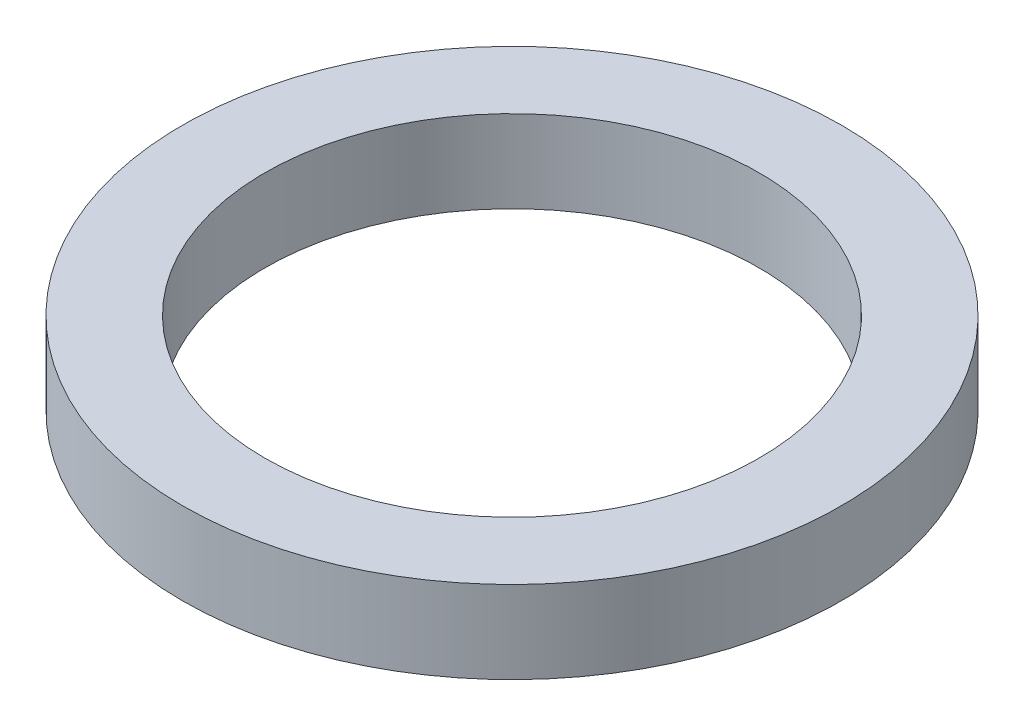
ISO-10303-21;
HEADER;
FILE_DESCRIPTION(('STEP AP214'),'2;1');
FILE_NAME('part.step','',(''),(''),'','','');
FILE_SCHEMA(('AUTOMOTIVE_DESIGN { 1 0 10303 214 1 1 1 1 }'));
ENDSEC;
DATA;
#1=APPLICATION_CONTEXT('core data for automotive mechanical design processes');
#2=APPLICATION_PROTOCOL_DEFINITION('international standard','automotive_design',2000,#1);
#3=PRODUCT_CONTEXT('',#1,'mechanical');
#4=PRODUCT('Part','Part','',(#3));
#5=PRODUCT_RELATED_PRODUCT_CATEGORY('part','',(#4));
#6=PRODUCT_DEFINITION_FORMATION('','',#4);
#7=PRODUCT_DEFINITION_CONTEXT('part definition',#1,'design');
#8=PRODUCT_DEFINITION('design','',#6,#7);
#9=PRODUCT_DEFINITION_SHAPE('','',#8);
#10=(LENGTH_UNIT() NAMED_UNIT(*) SI_UNIT(.MILLI.,.METRE.));
#11=(NAMED_UNIT(*) PLANE_ANGLE_UNIT() SI_UNIT($,.RADIAN.));
#12=(NAMED_UNIT(*) SI_UNIT($,.STERADIAN.) SOLID_ANGLE_UNIT());
#13=UNCERTAINTY_MEASURE_WITH_UNIT(LENGTH_MEASURE(1.E-05),#10,'distance_accuracy_value','');
#14=(GEOMETRIC_REPRESENTATION_CONTEXT(3) GLOBAL_UNCERTAINTY_ASSIGNED_CONTEXT((#13)) GLOBAL_UNIT_ASSIGNED_CONTEXT((#10,
#11,#12)) REPRESENTATION_CONTEXT('',''));
#15=CARTESIAN_POINT('',(0.,0.,0.));
#16=DIRECTION('',(0.,0.,1.));
#17=DIRECTION('',(1.,0.,0.));
#18=AXIS2_PLACEMENT_3D('',#15,#16,#17);
#19=CARTESIAN_POINT('',(0.,10.0729927007299,0.));
#20=DIRECTION('',(0.,1.,0.));
#21=DIRECTION('',(0.,0.,1.));
#22=AXIS2_PLACEMENT_3D('',#19,#20,#21);
#23=CYLINDRICAL_SURFACE('',#22,3.);
#24=CARTESIAN_POINT('',(0.,-0.5,0.));
#25=DIRECTION('',(0.,1.,0.));
#26=DIRECTION('',(0.,0.,1.));
#27=AXIS2_PLACEMENT_3D('',#24,#25,#26);
#28=CIRCLE('',#27,3.);
#29=CARTESIAN_POINT('',(0.,-0.5,3.));
#30=VERTEX_POINT('',#29);
#31=EDGE_CURVE('E10',#30,#30,#28,.T.);
#32=ORIENTED_EDGE('',*,*,#31,.F.);
#33=EDGE_LOOP('',(#32));
#34=FACE_BOUND('',#33,.T.);
#35=CARTESIAN_POINT('',(0.,0.5,0.));
#36=DIRECTION('',(0.,1.,0.));
#37=DIRECTION('',(0.,0.,1.));
#38=AXIS2_PLACEMENT_3D('',#35,#36,#37);
#39=CIRCLE('',#38,3.);
#40=CARTESIAN_POINT('',(0.,0.5,3.));
#41=VERTEX_POINT('',#40);
#42=EDGE_CURVE('E58',#41,#41,#39,.T.);
#43=ORIENTED_EDGE('',*,*,#42,.T.);
#44=EDGE_LOOP('',(#43));
#45=FACE_BOUND('',#44,.T.);
#46=ADVANCED_FACE('F41',(#34,#45),#23,.F.);
#47=CARTESIAN_POINT('',(0.,-0.5,-3.));
#48=DIRECTION('',(0.,1.,0.));
#49=DIRECTION('',(0.,0.,1.));
#50=AXIS2_PLACEMENT_3D('',#47,#48,#49);
#51=PLANE('',#50);
#52=CARTESIAN_POINT('',(0.,-0.5,0.));
#53=DIRECTION('',(0.,1.,0.));
#54=DIRECTION('',(0.,0.,1.));
#55=AXIS2_PLACEMENT_3D('',#52,#53,#54);
#56=CIRCLE('',#55,4.);
#57=CARTESIAN_POINT('',(0.,-0.5,4.));
#58=VERTEX_POINT('',#57);
#59=EDGE_CURVE('E48',#58,#58,#56,.T.);
#60=ORIENTED_EDGE('',*,*,#59,.F.);
#61=EDGE_LOOP('',(#60));
#62=FACE_BOUND('',#61,.T.);
#63=ORIENTED_EDGE('',*,*,#31,.T.);
#64=EDGE_LOOP('',(#63));
#65=FACE_BOUND('',#64,.T.);
#66=ADVANCED_FACE('F74',(#62,#65),#51,.F.);
#67=CARTESIAN_POINT('',(0.,10.0729927007299,0.));
#68=DIRECTION('',(0.,1.,0.));
#69=DIRECTION('',(0.,0.,1.));
#70=AXIS2_PLACEMENT_3D('',#67,#68,#69);
#71=CYLINDRICAL_SURFACE('',#70,4.);
#72=CARTESIAN_POINT('',(0.,0.5,0.));
#73=DIRECTION('',(0.,1.,0.));
#74=DIRECTION('',(0.,0.,1.));
#75=AXIS2_PLACEMENT_3D('',#72,#73,#74);
#76=CIRCLE('',#75,4.);
#77=CARTESIAN_POINT('',(0.,0.5,4.));
#78=VERTEX_POINT('',#77);
#79=EDGE_CURVE('E53',#78,#78,#76,.T.);
#80=ORIENTED_EDGE('',*,*,#79,.F.);
#81=EDGE_LOOP('',(#80));
#82=FACE_BOUND('',#81,.T.);
#83=ORIENTED_EDGE('',*,*,#59,.T.);
#84=EDGE_LOOP('',(#83));
#85=FACE_BOUND('',#84,.T.);
#86=ADVANCED_FACE('F69',(#82,#85),#71,.T.);
#87=CARTESIAN_POINT('',(0.,0.5,-3.));
#88=DIRECTION('',(0.,-1.,0.));
#89=DIRECTION('',(0.,0.,-1.));
#90=AXIS2_PLACEMENT_3D('',#87,#88,#89);
#91=PLANE('',#90);
#92=ORIENTED_EDGE('',*,*,#42,.F.);
#93=EDGE_LOOP('',(#92));
#94=FACE_BOUND('',#93,.T.);
#95=ORIENTED_EDGE('',*,*,#79,.T.);
#96=EDGE_LOOP('',(#95));
#97=FACE_BOUND('',#96,.T.);
#98=ADVANCED_FACE('F66',(#94,#97),#91,.F.);
#99=CLOSED_SHELL('',(#46,#66,#86,#98));
#100=MANIFOLD_SOLID_BREP('B2',#99);
#101=ADVANCED_BREP_SHAPE_REPRESENTATION('',(#18,#100),#14);
#102=SHAPE_DEFINITION_REPRESENTATION(#9,#101);
ENDSEC;
END-ISO-10303-21;
